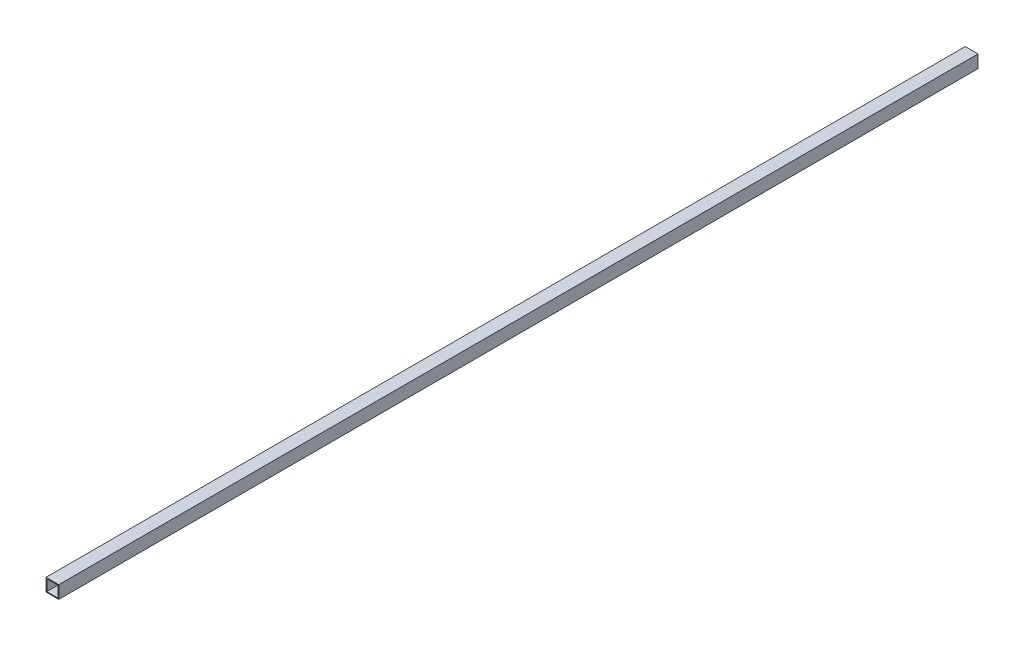
ISO-10303-21;
HEADER;
FILE_DESCRIPTION(('STEP AP214'),'2;1');
FILE_NAME('part.step','',(''),(''),'','','');
FILE_SCHEMA(('AUTOMOTIVE_DESIGN { 1 0 10303 214 1 1 1 1 }'));
ENDSEC;
DATA;
#1=APPLICATION_CONTEXT('core data for automotive mechanical design processes');
#2=APPLICATION_PROTOCOL_DEFINITION('international standard','automotive_design',2000,#1);
#3=PRODUCT_CONTEXT('',#1,'mechanical');
#4=PRODUCT('Part','Part','',(#3));
#5=PRODUCT_RELATED_PRODUCT_CATEGORY('part','',(#4));
#6=PRODUCT_DEFINITION_FORMATION('','',#4);
#7=PRODUCT_DEFINITION_CONTEXT('part definition',#1,'design');
#8=PRODUCT_DEFINITION('design','',#6,#7);
#9=PRODUCT_DEFINITION_SHAPE('','',#8);
#10=(LENGTH_UNIT() NAMED_UNIT(*) SI_UNIT(.MILLI.,.METRE.));
#11=(NAMED_UNIT(*) PLANE_ANGLE_UNIT() SI_UNIT($,.RADIAN.));
#12=(NAMED_UNIT(*) SI_UNIT($,.STERADIAN.) SOLID_ANGLE_UNIT());
#13=UNCERTAINTY_MEASURE_WITH_UNIT(LENGTH_MEASURE(1.E-05),#10,'distance_accuracy_value','');
#14=(GEOMETRIC_REPRESENTATION_CONTEXT(3) GLOBAL_UNCERTAINTY_ASSIGNED_CONTEXT((#13)) GLOBAL_UNIT_ASSIGNED_CONTEXT((#10,
#11,#12)) REPRESENTATION_CONTEXT('',''));
#15=CARTESIAN_POINT('',(0.,0.,0.));
#16=DIRECTION('',(0.,0.,1.));
#17=DIRECTION('',(1.,0.,0.));
#18=AXIS2_PLACEMENT_3D('',#15,#16,#17);
#19=CARTESIAN_POINT('',(11.0997999999894,-11.0997999999894,0.));
#20=DIRECTION('',(1.,0.,0.));
#21=DIRECTION('',(0.,1.,0.));
#22=AXIS2_PLACEMENT_3D('',#19,#20,#21);
#23=PLANE('',#22);
#24=DIRECTION('',(0.,0.,1.));
#25=VECTOR('',#24,1.);
#26=CARTESIAN_POINT('',(11.0997999999894,-11.0997999999894,0.));
#27=LINE('',#26,#25);
#28=CARTESIAN_POINT('',(11.0997999999894,-11.0997999999894,0.));
#29=VERTEX_POINT('',#28);
#30=CARTESIAN_POINT('',(11.0997999999894,-11.0997999999894,1828.8));
#31=VERTEX_POINT('',#30);
#32=EDGE_CURVE('E18',#29,#31,#27,.T.);
#33=ORIENTED_EDGE('',*,*,#32,.T.);
#34=DIRECTION('',(0.,1.,0.));
#35=VECTOR('',#34,1.);
#36=CARTESIAN_POINT('',(11.0997999999894,0.,1828.8));
#37=LINE('',#36,#35);
#38=CARTESIAN_POINT('',(11.0997999999894,11.0997999999894,1828.8));
#39=VERTEX_POINT('',#38);
#40=EDGE_CURVE('E123',#39,#31,#37,.F.);
#41=ORIENTED_EDGE('',*,*,#40,.F.);
#42=DIRECTION('',(0.,0.,1.));
#43=VECTOR('',#42,1.);
#44=CARTESIAN_POINT('',(11.0997999999894,11.0997999999894,0.));
#45=LINE('',#44,#43);
#46=CARTESIAN_POINT('',(11.0997999999894,11.0997999999894,0.));
#47=VERTEX_POINT('',#46);
#48=EDGE_CURVE('E108',#39,#47,#45,.F.);
#49=ORIENTED_EDGE('',*,*,#48,.T.);
#50=DIRECTION('',(0.,1.,0.));
#51=VECTOR('',#50,1.);
#52=CARTESIAN_POINT('',(11.0997999999894,0.,0.));
#53=LINE('',#52,#51);
#54=EDGE_CURVE('E103',#47,#29,#53,.F.);
#55=ORIENTED_EDGE('',*,*,#54,.T.);
#56=EDGE_LOOP('',(#33,#41,#49,#55));
#57=FACE_BOUND('',#56,.T.);
#58=ADVANCED_FACE('F15',(#57),#23,.F.);
#59=CARTESIAN_POINT('',(-11.0997999999894,-11.0997999999894,0.));
#60=DIRECTION('',(0.,-1.,0.));
#61=DIRECTION('',(1.,0.,0.));
#62=AXIS2_PLACEMENT_3D('',#59,#60,#61);
#63=PLANE('',#62);
#64=DIRECTION('',(0.,0.,1.));
#65=VECTOR('',#64,1.);
#66=CARTESIAN_POINT('',(-11.0997999999894,-11.0997999999894,0.));
#67=LINE('',#66,#65);
#68=CARTESIAN_POINT('',(-11.0997999999894,-11.0997999999894,0.));
#69=VERTEX_POINT('',#68);
#70=CARTESIAN_POINT('',(-11.0997999999894,-11.0997999999894,1828.8));
#71=VERTEX_POINT('',#70);
#72=EDGE_CURVE('E82',#69,#71,#67,.T.);
#73=ORIENTED_EDGE('',*,*,#72,.T.);
#74=DIRECTION('',(1.,0.,0.));
#75=VECTOR('',#74,1.);
#76=CARTESIAN_POINT('',(0.,-11.0997999999894,1828.8));
#77=LINE('',#76,#75);
#78=EDGE_CURVE('E121',#31,#71,#77,.F.);
#79=ORIENTED_EDGE('',*,*,#78,.F.);
#80=ORIENTED_EDGE('',*,*,#32,.F.);
#81=DIRECTION('',(1.,0.,0.));
#82=VECTOR('',#81,1.);
#83=CARTESIAN_POINT('',(0.,-11.0997999999894,0.));
#84=LINE('',#83,#82);
#85=EDGE_CURVE('E79',#29,#69,#84,.F.);
#86=ORIENTED_EDGE('',*,*,#85,.T.);
#87=EDGE_LOOP('',(#73,#79,#80,#86));
#88=FACE_BOUND('',#87,.T.);
#89=ADVANCED_FACE('F81',(#88),#63,.F.);
#90=CARTESIAN_POINT('',(-11.0997999999894,11.0997999999894,0.));
#91=DIRECTION('',(-1.,0.,0.));
#92=DIRECTION('',(0.,-1.,0.));
#93=AXIS2_PLACEMENT_3D('',#90,#91,#92);
#94=PLANE('',#93);
#95=DIRECTION('',(0.,0.,1.));
#96=VECTOR('',#95,1.);
#97=CARTESIAN_POINT('',(-11.0997999999894,11.0997999999894,0.));
#98=LINE('',#97,#96);
#99=CARTESIAN_POINT('',(-11.0997999999894,11.0997999999894,0.));
#100=VERTEX_POINT('',#99);
#101=CARTESIAN_POINT('',(-11.0997999999894,11.0997999999894,1828.8));
#102=VERTEX_POINT('',#101);
#103=EDGE_CURVE('E96',#100,#102,#98,.T.);
#104=ORIENTED_EDGE('',*,*,#103,.T.);
#105=DIRECTION('',(0.,1.,0.));
#106=VECTOR('',#105,1.);
#107=CARTESIAN_POINT('',(-11.0997999999894,0.,1828.8));
#108=LINE('',#107,#106);
#109=EDGE_CURVE('E94',#71,#102,#108,.T.);
#110=ORIENTED_EDGE('',*,*,#109,.F.);
#111=ORIENTED_EDGE('',*,*,#72,.F.);
#112=DIRECTION('',(0.,1.,0.));
#113=VECTOR('',#112,1.);
#114=CARTESIAN_POINT('',(-11.0997999999894,0.,0.));
#115=LINE('',#114,#113);
#116=EDGE_CURVE('E87',#69,#100,#115,.T.);
#117=ORIENTED_EDGE('',*,*,#116,.T.);
#118=EDGE_LOOP('',(#104,#110,#111,#117));
#119=FACE_BOUND('',#118,.T.);
#120=ADVANCED_FACE('F91',(#119),#94,.F.);
#121=CARTESIAN_POINT('',(11.0997999999894,11.0997999999894,0.));
#122=DIRECTION('',(0.,1.,0.));
#123=DIRECTION('',(-1.,0.,0.));
#124=AXIS2_PLACEMENT_3D('',#121,#122,#123);
#125=PLANE('',#124);
#126=ORIENTED_EDGE('',*,*,#48,.F.);
#127=DIRECTION('',(1.,0.,0.));
#128=VECTOR('',#127,1.);
#129=CARTESIAN_POINT('',(0.,11.0997999999894,1828.8));
#130=LINE('',#129,#128);
#131=EDGE_CURVE('E114',#102,#39,#130,.T.);
#132=ORIENTED_EDGE('',*,*,#131,.F.);
#133=ORIENTED_EDGE('',*,*,#103,.F.);
#134=DIRECTION('',(1.,0.,0.));
#135=VECTOR('',#134,1.);
#136=CARTESIAN_POINT('',(0.,11.0997999999894,0.));
#137=LINE('',#136,#135);
#138=EDGE_CURVE('E101',#100,#47,#137,.T.);
#139=ORIENTED_EDGE('',*,*,#138,.T.);
#140=EDGE_LOOP('',(#126,#132,#133,#139));
#141=FACE_BOUND('',#140,.T.);
#142=ADVANCED_FACE('F115',(#141),#125,.F.);
#143=CARTESIAN_POINT('',(12.7,-12.7,0.));
#144=DIRECTION('',(1.,0.,0.));
#145=DIRECTION('',(0.,1.,0.));
#146=AXIS2_PLACEMENT_3D('',#143,#144,#145);
#147=PLANE('',#146);
#148=DIRECTION('',(0.,1.,0.));
#149=VECTOR('',#148,1.);
#150=CARTESIAN_POINT('',(12.7,0.,1828.8));
#151=LINE('',#150,#149);
#152=CARTESIAN_POINT('',(12.7,-12.7,1828.8));
#153=VERTEX_POINT('',#152);
#154=CARTESIAN_POINT('',(12.7,12.7,1828.8));
#155=VERTEX_POINT('',#154);
#156=EDGE_CURVE('E128',#153,#155,#151,.T.);
#157=ORIENTED_EDGE('',*,*,#156,.F.);
#158=DIRECTION('',(0.,0.,-1.));
#159=VECTOR('',#158,1.);
#160=CARTESIAN_POINT('',(12.7,-12.7,0.));
#161=LINE('',#160,#159);
#162=CARTESIAN_POINT('',(12.7,-12.7,0.));
#163=VERTEX_POINT('',#162);
#164=EDGE_CURVE('E133',#163,#153,#161,.F.);
#165=ORIENTED_EDGE('',*,*,#164,.F.);
#166=DIRECTION('',(0.,1.,0.));
#167=VECTOR('',#166,1.);
#168=CARTESIAN_POINT('',(12.7,0.,0.));
#169=LINE('',#168,#167);
#170=CARTESIAN_POINT('',(12.7,12.7,0.));
#171=VERTEX_POINT('',#170);
#172=EDGE_CURVE('E88',#163,#171,#169,.T.);
#173=ORIENTED_EDGE('',*,*,#172,.T.);
#174=DIRECTION('',(0.,0.,1.));
#175=VECTOR('',#174,1.);
#176=CARTESIAN_POINT('',(12.7,12.7,0.));
#177=LINE('',#176,#175);
#178=EDGE_CURVE('E237',#155,#171,#177,.F.);
#179=ORIENTED_EDGE('',*,*,#178,.F.);
#180=EDGE_LOOP('',(#157,#165,#173,#179));
#181=FACE_BOUND('',#180,.T.);
#182=ADVANCED_FACE('F163',(#181),#147,.T.);
#183=CARTESIAN_POINT('',(0.,0.,0.));
#184=DIRECTION('',(0.,0.,1.));
#185=DIRECTION('',(1.,0.,0.));
#186=AXIS2_PLACEMENT_3D('',#183,#184,#185);
#187=PLANE('',#186);
#188=ORIENTED_EDGE('',*,*,#138,.F.);
#189=ORIENTED_EDGE('',*,*,#116,.F.);
#190=ORIENTED_EDGE('',*,*,#85,.F.);
#191=ORIENTED_EDGE('',*,*,#54,.F.);
#192=EDGE_LOOP('',(#188,#189,#190,#191));
#193=FACE_BOUND('',#192,.T.);
#194=DIRECTION('',(0.,-1.,0.));
#195=VECTOR('',#194,1.);
#196=CARTESIAN_POINT('',(-12.7,12.7,0.));
#197=LINE('',#196,#195);
#198=CARTESIAN_POINT('',(-12.7,12.7,0.));
#199=VERTEX_POINT('',#198);
#200=CARTESIAN_POINT('',(-12.7,-12.7,0.));
#201=VERTEX_POINT('',#200);
#202=EDGE_CURVE('E243',#199,#201,#197,.T.);
#203=ORIENTED_EDGE('',*,*,#202,.F.);
#204=DIRECTION('',(-1.,0.,0.));
#205=VECTOR('',#204,1.);
#206=CARTESIAN_POINT('',(12.7,12.7,0.));
#207=LINE('',#206,#205);
#208=EDGE_CURVE('E118',#171,#199,#207,.T.);
#209=ORIENTED_EDGE('',*,*,#208,.F.);
#210=ORIENTED_EDGE('',*,*,#172,.F.);
#211=DIRECTION('',(1.,0.,0.));
#212=VECTOR('',#211,1.);
#213=CARTESIAN_POINT('',(-12.7,-12.7,0.));
#214=LINE('',#213,#212);
#215=EDGE_CURVE('E135',#201,#163,#214,.T.);
#216=ORIENTED_EDGE('',*,*,#215,.F.);
#217=EDGE_LOOP('',(#203,#209,#210,#216));
#218=FACE_BOUND('',#217,.T.);
#219=ADVANCED_FACE('F98',(#193,#218),#187,.F.);
#220=CARTESIAN_POINT('',(-12.7,-12.7,0.));
#221=DIRECTION('',(0.,-1.,0.));
#222=DIRECTION('',(0.,0.,-1.));
#223=AXIS2_PLACEMENT_3D('',#220,#221,#222);
#224=PLANE('',#223);
#225=DIRECTION('',(1.,0.,0.));
#226=VECTOR('',#225,1.);
#227=CARTESIAN_POINT('',(0.,-12.7,1828.8));
#228=LINE('',#227,#226);
#229=CARTESIAN_POINT('',(-12.7,-12.7,1828.8));
#230=VERTEX_POINT('',#229);
#231=EDGE_CURVE('E130',#230,#153,#228,.T.);
#232=ORIENTED_EDGE('',*,*,#231,.F.);
#233=DIRECTION('',(0.,0.,1.));
#234=VECTOR('',#233,1.);
#235=CARTESIAN_POINT('',(-12.7,-12.7,0.));
#236=LINE('',#235,#234);
#237=EDGE_CURVE('E240',#201,#230,#236,.T.);
#238=ORIENTED_EDGE('',*,*,#237,.F.);
#239=ORIENTED_EDGE('',*,*,#215,.T.);
#240=ORIENTED_EDGE('',*,*,#164,.T.);
#241=EDGE_LOOP('',(#232,#238,#239,#240));
#242=FACE_BOUND('',#241,.T.);
#243=ADVANCED_FACE('F157',(#242),#224,.T.);
#244=CARTESIAN_POINT('',(0.,0.,1828.8));
#245=DIRECTION('',(0.,0.,1.));
#246=DIRECTION('',(1.,0.,0.));
#247=AXIS2_PLACEMENT_3D('',#244,#245,#246);
#248=PLANE('',#247);
#249=ORIENTED_EDGE('',*,*,#109,.T.);
#250=ORIENTED_EDGE('',*,*,#131,.T.);
#251=ORIENTED_EDGE('',*,*,#40,.T.);
#252=ORIENTED_EDGE('',*,*,#78,.T.);
#253=EDGE_LOOP('',(#249,#250,#251,#252));
#254=FACE_BOUND('',#253,.T.);
#255=DIRECTION('',(-1.,0.,0.));
#256=VECTOR('',#255,1.);
#257=CARTESIAN_POINT('',(12.7,12.7,1828.8));
#258=LINE('',#257,#256);
#259=CARTESIAN_POINT('',(-12.7,12.7,1828.8));
#260=VERTEX_POINT('',#259);
#261=EDGE_CURVE('E33',#260,#155,#258,.F.);
#262=ORIENTED_EDGE('',*,*,#261,.F.);
#263=DIRECTION('',(0.,-1.,0.));
#264=VECTOR('',#263,1.);
#265=CARTESIAN_POINT('',(-12.7,12.7,1828.8));
#266=LINE('',#265,#264);
#267=EDGE_CURVE('E24',#230,#260,#266,.F.);
#268=ORIENTED_EDGE('',*,*,#267,.F.);
#269=ORIENTED_EDGE('',*,*,#231,.T.);
#270=ORIENTED_EDGE('',*,*,#156,.T.);
#271=EDGE_LOOP('',(#262,#268,#269,#270));
#272=FACE_BOUND('',#271,.T.);
#273=ADVANCED_FACE('F120',(#254,#272),#248,.T.);
#274=CARTESIAN_POINT('',(12.7,12.7,0.));
#275=DIRECTION('',(0.,1.,0.));
#276=DIRECTION('',(-1.,0.,0.));
#277=AXIS2_PLACEMENT_3D('',#274,#275,#276);
#278=PLANE('',#277);
#279=ORIENTED_EDGE('',*,*,#261,.T.);
#280=ORIENTED_EDGE('',*,*,#178,.T.);
#281=ORIENTED_EDGE('',*,*,#208,.T.);
#282=DIRECTION('',(0.,0.,1.));
#283=VECTOR('',#282,1.);
#284=CARTESIAN_POINT('',(-12.7,12.7,0.));
#285=LINE('',#284,#283);
#286=EDGE_CURVE('E9',#260,#199,#285,.F.);
#287=ORIENTED_EDGE('',*,*,#286,.F.);
#288=EDGE_LOOP('',(#279,#280,#281,#287));
#289=FACE_BOUND('',#288,.T.);
#290=ADVANCED_FACE('F145',(#289),#278,.T.);
#291=CARTESIAN_POINT('',(-12.7,12.7,0.));
#292=DIRECTION('',(-1.,0.,0.));
#293=DIRECTION('',(0.,-1.,0.));
#294=AXIS2_PLACEMENT_3D('',#291,#292,#293);
#295=PLANE('',#294);
#296=ORIENTED_EDGE('',*,*,#267,.T.);
#297=ORIENTED_EDGE('',*,*,#286,.T.);
#298=ORIENTED_EDGE('',*,*,#202,.T.);
#299=ORIENTED_EDGE('',*,*,#237,.T.);
#300=EDGE_LOOP('',(#296,#297,#298,#299));
#301=FACE_BOUND('',#300,.T.);
#302=ADVANCED_FACE('F143',(#301),#295,.T.);
#303=CLOSED_SHELL('',(#58,#89,#120,#142,#182,#219,#243,#273,#290,#302));
#304=MANIFOLD_SOLID_BREP('B1',#303);
#305=ADVANCED_BREP_SHAPE_REPRESENTATION('',(#18,#304),#14);
#306=SHAPE_DEFINITION_REPRESENTATION(#9,#305);
ENDSEC;
END-ISO-10303-21;
